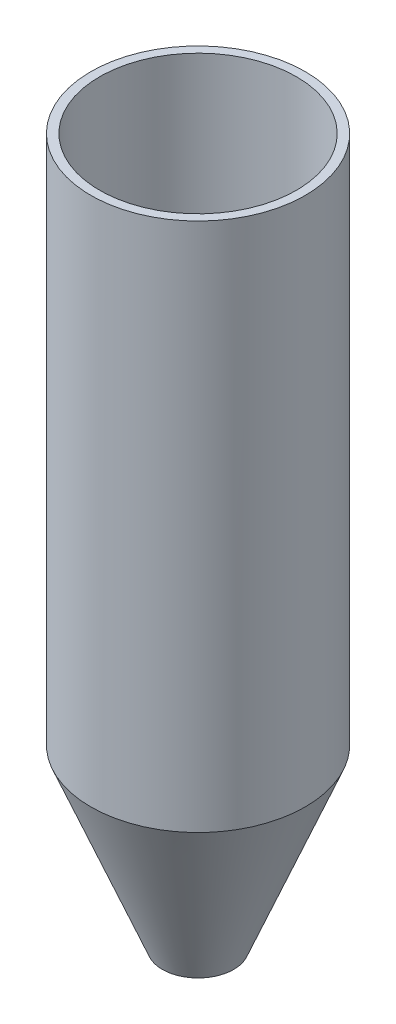
ISO-10303-21;
HEADER;
FILE_DESCRIPTION(('STEP AP214'),'2;1');
FILE_NAME('part.step','',(''),(''),'','','');
FILE_SCHEMA(('AUTOMOTIVE_DESIGN { 1 0 10303 214 1 1 1 1 }'));
ENDSEC;
DATA;
#1=APPLICATION_CONTEXT('core data for automotive mechanical design processes');
#2=APPLICATION_PROTOCOL_DEFINITION('international standard','automotive_design',2000,#1);
#3=PRODUCT_CONTEXT('',#1,'mechanical');
#4=PRODUCT('Part','Part','',(#3));
#5=PRODUCT_RELATED_PRODUCT_CATEGORY('part','',(#4));
#6=PRODUCT_DEFINITION_FORMATION('','',#4);
#7=PRODUCT_DEFINITION_CONTEXT('part definition',#1,'design');
#8=PRODUCT_DEFINITION('design','',#6,#7);
#9=PRODUCT_DEFINITION_SHAPE('','',#8);
#10=(LENGTH_UNIT() NAMED_UNIT(*) SI_UNIT(.MILLI.,.METRE.));
#11=(NAMED_UNIT(*) PLANE_ANGLE_UNIT() SI_UNIT($,.RADIAN.));
#12=(NAMED_UNIT(*) SI_UNIT($,.STERADIAN.) SOLID_ANGLE_UNIT());
#13=UNCERTAINTY_MEASURE_WITH_UNIT(LENGTH_MEASURE(1.E-05),#10,'distance_accuracy_value','');
#14=(GEOMETRIC_REPRESENTATION_CONTEXT(3) GLOBAL_UNCERTAINTY_ASSIGNED_CONTEXT((#13)) GLOBAL_UNIT_ASSIGNED_CONTEXT((#10,
#11,#12)) REPRESENTATION_CONTEXT('',''));
#15=CARTESIAN_POINT('',(0.,0.,0.));
#16=DIRECTION('',(0.,0.,1.));
#17=DIRECTION('',(1.,0.,0.));
#18=AXIS2_PLACEMENT_3D('',#15,#16,#17);
#19=CARTESIAN_POINT('',(0.,3.,0.));
#20=DIRECTION('',(0.,1.,0.));
#21=DIRECTION('',(0.,0.,1.));
#22=AXIS2_PLACEMENT_3D('',#19,#20,#21);
#23=CONICAL_SURFACE('',#22,1.215,0.384809276545861);
#24=CARTESIAN_POINT('',(0.,3.,0.));
#25=DIRECTION('',(0.,-1.,0.));
#26=DIRECTION('',(0.,0.,-1.));
#27=AXIS2_PLACEMENT_3D('',#24,#25,#26);
#28=CIRCLE('',#27,1.215);
#29=CARTESIAN_POINT('',(0.,3.,-1.215));
#30=VERTEX_POINT('',#29);
#31=EDGE_CURVE('E10',#30,#30,#28,.T.);
#32=ORIENTED_EDGE('',*,*,#31,.T.);
#33=EDGE_LOOP('',(#32));
#34=FACE_BOUND('',#33,.T.);
#35=CARTESIAN_POINT('',(0.,1.,0.));
#36=DIRECTION('',(0.,1.,0.));
#37=DIRECTION('',(0.,0.,1.));
#38=AXIS2_PLACEMENT_3D('',#35,#36,#37);
#39=CIRCLE('',#38,0.405);
#40=CARTESIAN_POINT('',(0.,1.,0.405000000000001));
#41=VERTEX_POINT('',#40);
#42=EDGE_CURVE('E51',#41,#41,#39,.F.);
#43=ORIENTED_EDGE('',*,*,#42,.F.);
#44=EDGE_LOOP('',(#43));
#45=FACE_BOUND('',#44,.T.);
#46=ADVANCED_FACE('F32',(#34,#45),#23,.T.);
#47=CARTESIAN_POINT('',(0.,0.26639503769843,0.));
#48=DIRECTION('',(0.,1.,0.));
#49=DIRECTION('',(0.,0.,1.));
#50=AXIS2_PLACEMENT_3D('',#47,#48,#49);
#51=CONICAL_SURFACE('',#50,0.,0.384809276545861);
#52=CARTESIAN_POINT('',(0.,3.01948145745153,0.));
#53=DIRECTION('',(0.,-1.,0.));
#54=DIRECTION('',(0.,0.,-1.));
#55=AXIS2_PLACEMENT_3D('',#52,#53,#54);
#56=CIRCLE('',#55,1.115);
#57=CARTESIAN_POINT('',(0.,3.01948145745153,-1.115));
#58=VERTEX_POINT('',#57);
#59=EDGE_CURVE('E48',#58,#58,#56,.T.);
#60=ORIENTED_EDGE('',*,*,#59,.F.);
#61=EDGE_LOOP('',(#60));
#62=FACE_BOUND('',#61,.T.);
#63=CARTESIAN_POINT('',(0.,1.26639503769843,0.));
#64=DIRECTION('',(0.,1.,0.));
#65=DIRECTION('',(0.,0.,1.));
#66=AXIS2_PLACEMENT_3D('',#63,#64,#65);
#67=CIRCLE('',#66,0.405);
#68=CARTESIAN_POINT('',(0.,1.26639503769843,0.405000000000001));
#69=VERTEX_POINT('',#68);
#70=EDGE_CURVE('E35',#69,#69,#67,.T.);
#71=ORIENTED_EDGE('',*,*,#70,.F.);
#72=EDGE_LOOP('',(#71));
#73=FACE_BOUND('',#72,.T.);
#74=ADVANCED_FACE('F60',(#62,#73),#51,.F.);
#75=CARTESIAN_POINT('',(0.,0.,0.));
#76=DIRECTION('',(0.,-1.,0.));
#77=DIRECTION('',(0.,0.,-1.));
#78=AXIS2_PLACEMENT_3D('',#75,#76,#77);
#79=CYLINDRICAL_SURFACE('',#78,1.215);
#80=ORIENTED_EDGE('',*,*,#31,.F.);
#81=EDGE_LOOP('',(#80));
#82=FACE_BOUND('',#81,.T.);
#83=CARTESIAN_POINT('',(0.,8.99999999999999,0.));
#84=DIRECTION('',(0.,-1.,0.));
#85=DIRECTION('',(0.,0.,-1.));
#86=AXIS2_PLACEMENT_3D('',#83,#84,#85);
#87=CIRCLE('',#86,1.215);
#88=CARTESIAN_POINT('',(0.,8.99999999999999,-1.215));
#89=VERTEX_POINT('',#88);
#90=EDGE_CURVE('E39',#89,#89,#87,.T.);
#91=ORIENTED_EDGE('',*,*,#90,.T.);
#92=EDGE_LOOP('',(#91));
#93=FACE_BOUND('',#92,.T.);
#94=ADVANCED_FACE('F62',(#82,#93),#79,.T.);
#95=CARTESIAN_POINT('',(-1.215,8.99999999999999,0.));
#96=DIRECTION('',(0.,-1.,0.));
#97=DIRECTION('',(0.,0.,-1.));
#98=AXIS2_PLACEMENT_3D('',#95,#96,#97);
#99=PLANE('',#98);
#100=ORIENTED_EDGE('',*,*,#90,.F.);
#101=EDGE_LOOP('',(#100));
#102=FACE_BOUND('',#101,.T.);
#103=CARTESIAN_POINT('',(0.,8.99999999999999,0.));
#104=DIRECTION('',(0.,-1.,0.));
#105=DIRECTION('',(0.,0.,-1.));
#106=AXIS2_PLACEMENT_3D('',#103,#104,#105);
#107=CIRCLE('',#106,1.115);
#108=CARTESIAN_POINT('',(0.,8.99999999999999,-1.115));
#109=VERTEX_POINT('',#108);
#110=EDGE_CURVE('E43',#109,#109,#107,.T.);
#111=ORIENTED_EDGE('',*,*,#110,.T.);
#112=EDGE_LOOP('',(#111));
#113=FACE_BOUND('',#112,.T.);
#114=ADVANCED_FACE('F69',(#102,#113),#99,.F.);
#115=CARTESIAN_POINT('',(0.,0.,0.));
#116=DIRECTION('',(0.,-1.,0.));
#117=DIRECTION('',(0.,0.,-1.));
#118=AXIS2_PLACEMENT_3D('',#115,#116,#117);
#119=CYLINDRICAL_SURFACE('',#118,1.115);
#120=ORIENTED_EDGE('',*,*,#110,.F.);
#121=EDGE_LOOP('',(#120));
#122=FACE_BOUND('',#121,.T.);
#123=ORIENTED_EDGE('',*,*,#59,.T.);
#124=EDGE_LOOP('',(#123));
#125=FACE_BOUND('',#124,.T.);
#126=ADVANCED_FACE('F74',(#122,#125),#119,.F.);
#127=CARTESIAN_POINT('',(0.,9.99999999999999,0.));
#128=DIRECTION('',(0.,-1.,0.));
#129=DIRECTION('',(0.,0.,-1.));
#130=AXIS2_PLACEMENT_3D('',#127,#128,#129);
#131=CYLINDRICAL_SURFACE('',#130,0.405);
#132=ORIENTED_EDGE('',*,*,#70,.T.);
#133=EDGE_LOOP('',(#132));
#134=FACE_BOUND('',#133,.T.);
#135=ORIENTED_EDGE('',*,*,#42,.T.);
#136=EDGE_LOOP('',(#135));
#137=FACE_BOUND('',#136,.T.);
#138=ADVANCED_FACE('F58',(#134,#137),#131,.F.);
#139=CLOSED_SHELL('',(#46,#74,#94,#114,#126,#138));
#140=MANIFOLD_SOLID_BREP('B2',#139);
#141=ADVANCED_BREP_SHAPE_REPRESENTATION('',(#18,#140),#14);
#142=SHAPE_DEFINITION_REPRESENTATION(#9,#141);
ENDSEC;
END-ISO-10303-21;
